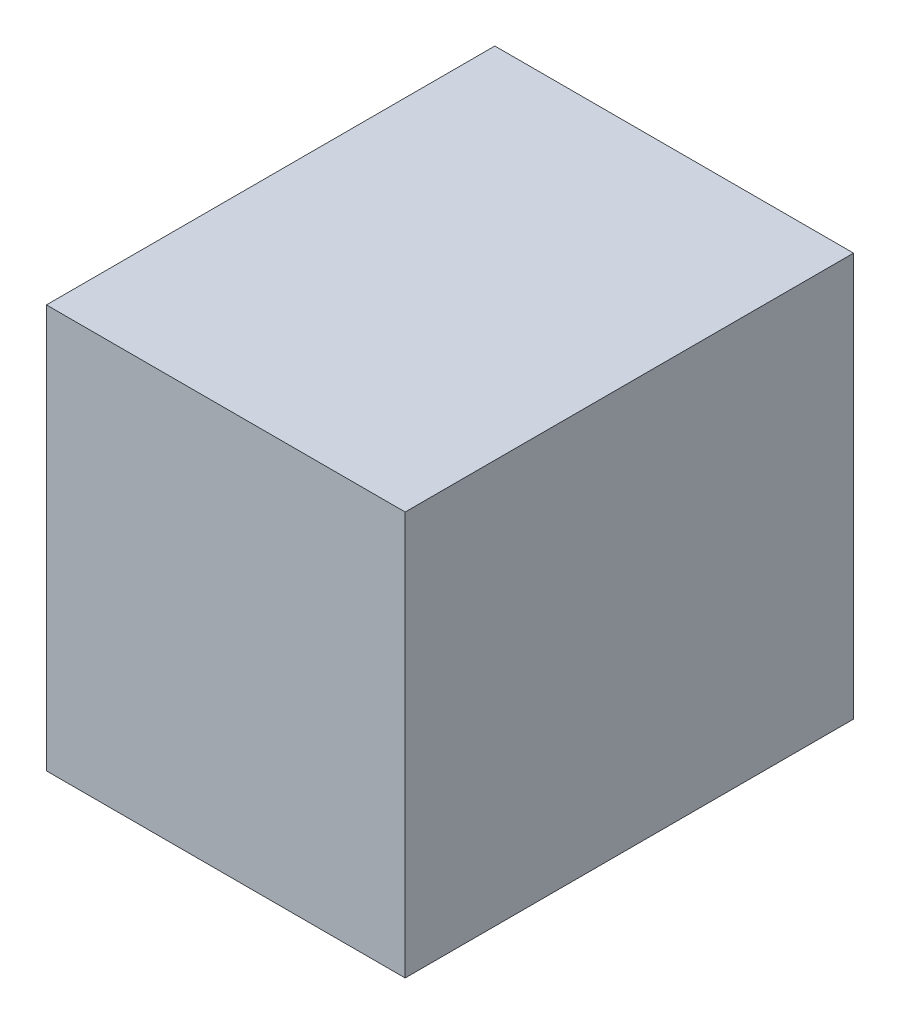
ISO-10303-21;
HEADER;
FILE_DESCRIPTION(('STEP AP214'),'2;1');
FILE_NAME('part.step','',(''),(''),'','','');
FILE_SCHEMA(('AUTOMOTIVE_DESIGN { 1 0 10303 214 1 1 1 1 }'));
ENDSEC;
DATA;
#1=APPLICATION_CONTEXT('core data for automotive mechanical design processes');
#2=APPLICATION_PROTOCOL_DEFINITION('international standard','automotive_design',2000,#1);
#3=PRODUCT_CONTEXT('',#1,'mechanical');
#4=PRODUCT('Part','Part','',(#3));
#5=PRODUCT_RELATED_PRODUCT_CATEGORY('part','',(#4));
#6=PRODUCT_DEFINITION_FORMATION('','',#4);
#7=PRODUCT_DEFINITION_CONTEXT('part definition',#1,'design');
#8=PRODUCT_DEFINITION('design','',#6,#7);
#9=PRODUCT_DEFINITION_SHAPE('','',#8);
#10=(LENGTH_UNIT() NAMED_UNIT(*) SI_UNIT(.MILLI.,.METRE.));
#11=(NAMED_UNIT(*) PLANE_ANGLE_UNIT() SI_UNIT($,.RADIAN.));
#12=(NAMED_UNIT(*) SI_UNIT($,.STERADIAN.) SOLID_ANGLE_UNIT());
#13=UNCERTAINTY_MEASURE_WITH_UNIT(LENGTH_MEASURE(1.E-05),#10,'distance_accuracy_value','');
#14=(GEOMETRIC_REPRESENTATION_CONTEXT(3) GLOBAL_UNCERTAINTY_ASSIGNED_CONTEXT((#13)) GLOBAL_UNIT_ASSIGNED_CONTEXT((#10,
#11,#12)) REPRESENTATION_CONTEXT('',''));
#15=CARTESIAN_POINT('',(0.,0.,0.));
#16=DIRECTION('',(0.,0.,1.));
#17=DIRECTION('',(1.,0.,0.));
#18=AXIS2_PLACEMENT_3D('',#15,#16,#17);
#19=CARTESIAN_POINT('',(0.,90.,0.));
#20=DIRECTION('',(-1.,0.,0.));
#21=DIRECTION('',(0.,0.,1.));
#22=AXIS2_PLACEMENT_3D('',#19,#20,#21);
#23=PLANE('',#22);
#24=DIRECTION('',(0.,0.,-1.));
#25=VECTOR('',#24,1.);
#26=CARTESIAN_POINT('',(0.,0.,0.));
#27=LINE('',#26,#25);
#28=CARTESIAN_POINT('',(0.,0.,0.));
#29=VERTEX_POINT('',#28);
#30=CARTESIAN_POINT('',(0.,0.,-100.));
#31=VERTEX_POINT('',#30);
#32=EDGE_CURVE('E76',#29,#31,#27,.T.);
#33=ORIENTED_EDGE('',*,*,#32,.T.);
#34=DIRECTION('',(0.,-1.,0.));
#35=VECTOR('',#34,1.);
#36=CARTESIAN_POINT('',(0.,90.,-100.));
#37=LINE('',#36,#35);
#38=CARTESIAN_POINT('',(0.,90.,-100.));
#39=VERTEX_POINT('',#38);
#40=EDGE_CURVE('E11',#39,#31,#37,.T.);
#41=ORIENTED_EDGE('',*,*,#40,.F.);
#42=DIRECTION('',(0.,0.,-1.));
#43=VECTOR('',#42,1.);
#44=CARTESIAN_POINT('',(0.,90.,0.));
#45=LINE('',#44,#43);
#46=CARTESIAN_POINT('',(0.,90.,0.));
#47=VERTEX_POINT('',#46);
#48=EDGE_CURVE('E94',#47,#39,#45,.T.);
#49=ORIENTED_EDGE('',*,*,#48,.F.);
#50=DIRECTION('',(0.,-1.,0.));
#51=VECTOR('',#50,1.);
#52=CARTESIAN_POINT('',(0.,90.,0.));
#53=LINE('',#52,#51);
#54=EDGE_CURVE('E88',#47,#29,#53,.T.);
#55=ORIENTED_EDGE('',*,*,#54,.T.);
#56=EDGE_LOOP('',(#33,#41,#49,#55));
#57=FACE_BOUND('',#56,.T.);
#58=ADVANCED_FACE('F32',(#57),#23,.F.);
#59=CARTESIAN_POINT('',(0.,90.,-100.));
#60=DIRECTION('',(0.,0.,1.));
#61=DIRECTION('',(1.,0.,0.));
#62=AXIS2_PLACEMENT_3D('',#59,#60,#61);
#63=PLANE('',#62);
#64=DIRECTION('',(-1.,0.,0.));
#65=VECTOR('',#64,1.);
#66=CARTESIAN_POINT('',(0.,0.,-100.));
#67=LINE('',#66,#65);
#68=CARTESIAN_POINT('',(-80.,0.,-100.));
#69=VERTEX_POINT('',#68);
#70=EDGE_CURVE('E72',#31,#69,#67,.T.);
#71=ORIENTED_EDGE('',*,*,#70,.T.);
#72=DIRECTION('',(0.,-1.,0.));
#73=VECTOR('',#72,1.);
#74=CARTESIAN_POINT('',(-80.,90.,-100.));
#75=LINE('',#74,#73);
#76=CARTESIAN_POINT('',(-80.,90.,-100.));
#77=VERTEX_POINT('',#76);
#78=EDGE_CURVE('E39',#77,#69,#75,.T.);
#79=ORIENTED_EDGE('',*,*,#78,.F.);
#80=DIRECTION('',(-1.,0.,0.));
#81=VECTOR('',#80,1.);
#82=CARTESIAN_POINT('',(0.,90.,-100.));
#83=LINE('',#82,#81);
#84=EDGE_CURVE('E84',#39,#77,#83,.T.);
#85=ORIENTED_EDGE('',*,*,#84,.F.);
#86=ORIENTED_EDGE('',*,*,#40,.T.);
#87=EDGE_LOOP('',(#71,#79,#85,#86));
#88=FACE_BOUND('',#87,.T.);
#89=ADVANCED_FACE('F83',(#88),#63,.F.);
#90=CARTESIAN_POINT('',(-80.,90.,0.));
#91=DIRECTION('',(1.,0.,0.));
#92=DIRECTION('',(0.,0.,-1.));
#93=AXIS2_PLACEMENT_3D('',#90,#91,#92);
#94=PLANE('',#93);
#95=DIRECTION('',(0.,0.,1.));
#96=VECTOR('',#95,1.);
#97=CARTESIAN_POINT('',(-80.,0.,0.));
#98=LINE('',#97,#96);
#99=CARTESIAN_POINT('',(-80.,0.,0.));
#100=VERTEX_POINT('',#99);
#101=EDGE_CURVE('E77',#69,#100,#98,.T.);
#102=ORIENTED_EDGE('',*,*,#101,.T.);
#103=DIRECTION('',(0.,-1.,0.));
#104=VECTOR('',#103,1.);
#105=CARTESIAN_POINT('',(-80.,90.,0.));
#106=LINE('',#105,#104);
#107=CARTESIAN_POINT('',(-80.,90.,0.));
#108=VERTEX_POINT('',#107);
#109=EDGE_CURVE('E100',#108,#100,#106,.T.);
#110=ORIENTED_EDGE('',*,*,#109,.F.);
#111=DIRECTION('',(0.,0.,1.));
#112=VECTOR('',#111,1.);
#113=CARTESIAN_POINT('',(-80.,90.,0.));
#114=LINE('',#113,#112);
#115=EDGE_CURVE('E51',#77,#108,#114,.T.);
#116=ORIENTED_EDGE('',*,*,#115,.F.);
#117=ORIENTED_EDGE('',*,*,#78,.T.);
#118=EDGE_LOOP('',(#102,#110,#116,#117));
#119=FACE_BOUND('',#118,.T.);
#120=ADVANCED_FACE('F103',(#119),#94,.F.);
#121=CARTESIAN_POINT('',(0.,90.,0.));
#122=DIRECTION('',(0.,0.,-1.));
#123=DIRECTION('',(-1.,0.,0.));
#124=AXIS2_PLACEMENT_3D('',#121,#122,#123);
#125=PLANE('',#124);
#126=DIRECTION('',(1.,0.,0.));
#127=VECTOR('',#126,1.);
#128=CARTESIAN_POINT('',(0.,0.,0.));
#129=LINE('',#128,#127);
#130=EDGE_CURVE('E92',#100,#29,#129,.T.);
#131=ORIENTED_EDGE('',*,*,#130,.T.);
#132=ORIENTED_EDGE('',*,*,#54,.F.);
#133=DIRECTION('',(1.,0.,0.));
#134=VECTOR('',#133,1.);
#135=CARTESIAN_POINT('',(0.,90.,0.));
#136=LINE('',#135,#134);
#137=EDGE_CURVE('E46',#108,#47,#136,.T.);
#138=ORIENTED_EDGE('',*,*,#137,.F.);
#139=ORIENTED_EDGE('',*,*,#109,.T.);
#140=EDGE_LOOP('',(#131,#132,#138,#139));
#141=FACE_BOUND('',#140,.T.);
#142=ADVANCED_FACE('F105',(#141),#125,.F.);
#143=CARTESIAN_POINT('',(0.,90.,0.));
#144=DIRECTION('',(0.,1.,0.));
#145=DIRECTION('',(0.,0.,1.));
#146=AXIS2_PLACEMENT_3D('',#143,#144,#145);
#147=PLANE('',#146);
#148=ORIENTED_EDGE('',*,*,#48,.T.);
#149=ORIENTED_EDGE('',*,*,#84,.T.);
#150=ORIENTED_EDGE('',*,*,#115,.T.);
#151=ORIENTED_EDGE('',*,*,#137,.T.);
#152=EDGE_LOOP('',(#148,#149,#150,#151));
#153=FACE_BOUND('',#152,.T.);
#154=ADVANCED_FACE('F106',(#153),#147,.T.);
#155=CARTESIAN_POINT('',(0.,0.,0.));
#156=DIRECTION('',(0.,1.,0.));
#157=DIRECTION('',(0.,0.,1.));
#158=AXIS2_PLACEMENT_3D('',#155,#156,#157);
#159=PLANE('',#158);
#160=ORIENTED_EDGE('',*,*,#32,.F.);
#161=ORIENTED_EDGE('',*,*,#130,.F.);
#162=ORIENTED_EDGE('',*,*,#101,.F.);
#163=ORIENTED_EDGE('',*,*,#70,.F.);
#164=EDGE_LOOP('',(#160,#161,#162,#163));
#165=FACE_BOUND('',#164,.T.);
#166=ADVANCED_FACE('F73',(#165),#159,.F.);
#167=CLOSED_SHELL('',(#58,#89,#120,#142,#154,#166));
#168=MANIFOLD_SOLID_BREP('B2',#167);
#169=ADVANCED_BREP_SHAPE_REPRESENTATION('',(#18,#168),#14);
#170=SHAPE_DEFINITION_REPRESENTATION(#9,#169);
ENDSEC;
END-ISO-10303-21;
